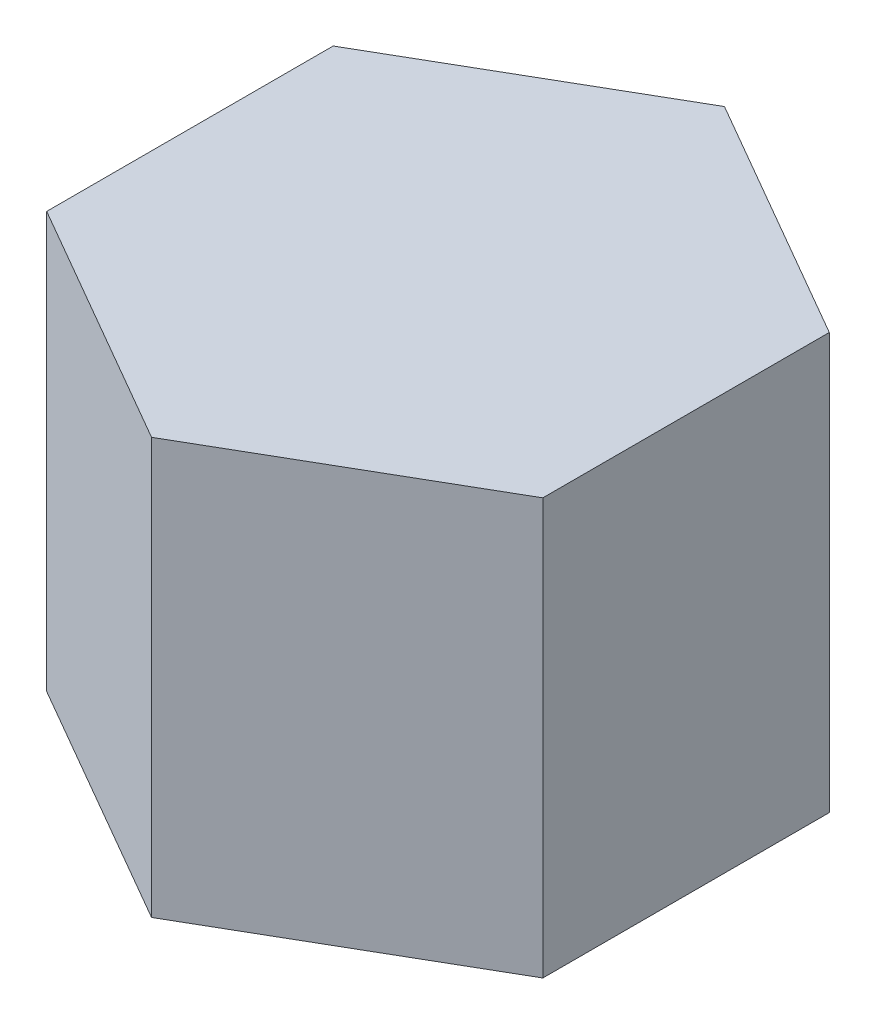
ISO-10303-21;
HEADER;
FILE_DESCRIPTION(('STEP AP214'),'2;1');
FILE_NAME('part.step','',(''),(''),'','','');
FILE_SCHEMA(('AUTOMOTIVE_DESIGN { 1 0 10303 214 1 1 1 1 }'));
ENDSEC;
DATA;
#1=APPLICATION_CONTEXT('core data for automotive mechanical design processes');
#2=APPLICATION_PROTOCOL_DEFINITION('international standard','automotive_design',2000,#1);
#3=PRODUCT_CONTEXT('',#1,'mechanical');
#4=PRODUCT('Part','Part','',(#3));
#5=PRODUCT_RELATED_PRODUCT_CATEGORY('part','',(#4));
#6=PRODUCT_DEFINITION_FORMATION('','',#4);
#7=PRODUCT_DEFINITION_CONTEXT('part definition',#1,'design');
#8=PRODUCT_DEFINITION('design','',#6,#7);
#9=PRODUCT_DEFINITION_SHAPE('','',#8);
#10=(LENGTH_UNIT() NAMED_UNIT(*) SI_UNIT(.MILLI.,.METRE.));
#11=(NAMED_UNIT(*) PLANE_ANGLE_UNIT() SI_UNIT($,.RADIAN.));
#12=(NAMED_UNIT(*) SI_UNIT($,.STERADIAN.) SOLID_ANGLE_UNIT());
#13=UNCERTAINTY_MEASURE_WITH_UNIT(LENGTH_MEASURE(1.E-05),#10,'distance_accuracy_value','');
#14=(GEOMETRIC_REPRESENTATION_CONTEXT(3) GLOBAL_UNCERTAINTY_ASSIGNED_CONTEXT((#13)) GLOBAL_UNIT_ASSIGNED_CONTEXT((#10,
#11,#12)) REPRESENTATION_CONTEXT('',''));
#15=CARTESIAN_POINT('',(0.,0.,0.));
#16=DIRECTION('',(0.,0.,1.));
#17=DIRECTION('',(1.,0.,0.));
#18=AXIS2_PLACEMENT_3D('',#15,#16,#17);
#19=CARTESIAN_POINT('',(210.642660308706,-148.537700895744,291.506971220494));
#20=DIRECTION('',(-0.499999999999909,0.,-0.866025403784491));
#21=DIRECTION('',(-0.866025403784491,0.,0.499999999999909));
#22=AXIS2_PLACEMENT_3D('',#19,#20,#21);
#23=PLANE('',#22);
#24=CARTESIAN_POINT('',(210.339551417382,-149.045793579175,291.681971220494));
#25=DIRECTION('',(0.866025403784491,0.,-0.499999999999909));
#26=VECTOR('',#25,1.);
#27=LINE('',#24,#26);
#28=CARTESIAN_POINT('',(210.339551417382,-149.045793579175,291.681971220494));
#29=VERTEX_POINT('',#28);
#30=CARTESIAN_POINT('',(210.642660308706,-149.045793579175,291.506971220494));
#31=VERTEX_POINT('',#30);
#32=EDGE_CURVE('E170',#29,#31,#27,.T.);
#33=ORIENTED_EDGE('',*,*,#32,.T.);
#34=CARTESIAN_POINT('',(210.642660308706,-148.537700895744,291.506971220494));
#35=DIRECTION('',(0.,-1.,0.));
#36=VECTOR('',#35,1.);
#37=LINE('',#34,#36);
#38=CARTESIAN_POINT('',(210.642660308706,-148.537700895744,291.506971220494));
#39=VERTEX_POINT('',#38);
#40=EDGE_CURVE('E35',#39,#31,#37,.T.);
#41=ORIENTED_EDGE('',*,*,#40,.F.);
#42=CARTESIAN_POINT('',(210.339551417382,-148.537700895744,291.681971220494));
#43=DIRECTION('',(0.866025403784491,0.,-0.499999999999909));
#44=VECTOR('',#43,1.);
#45=LINE('',#42,#44);
#46=CARTESIAN_POINT('',(210.339551417382,-148.537700895744,291.681971220494));
#47=VERTEX_POINT('',#46);
#48=EDGE_CURVE('E159',#47,#39,#45,.T.);
#49=ORIENTED_EDGE('',*,*,#48,.F.);
#50=CARTESIAN_POINT('',(210.339551417382,-148.537700895744,291.681971220494));
#51=DIRECTION('',(0.,-1.,0.));
#52=VECTOR('',#51,1.);
#53=LINE('',#50,#52);
#54=EDGE_CURVE('E10',#47,#29,#53,.T.);
#55=ORIENTED_EDGE('',*,*,#54,.T.);
#56=EDGE_LOOP('',(#33,#41,#49,#55));
#57=FACE_BOUND('',#56,.T.);
#58=ADVANCED_FACE('F16',(#57),#23,.F.);
#59=CARTESIAN_POINT('',(210.339551417382,-148.537700895744,291.681971220494));
#60=DIRECTION('',(0.500000000000096,0.,-0.866025403784383));
#61=DIRECTION('',(-0.866025403784383,0.,-0.500000000000096));
#62=AXIS2_PLACEMENT_3D('',#59,#60,#61);
#63=PLANE('',#62);
#64=CARTESIAN_POINT('',(210.036442526057,-149.045793579175,291.506971220494));
#65=DIRECTION('',(0.866025403784383,0.,0.500000000000096));
#66=VECTOR('',#65,1.);
#67=LINE('',#64,#66);
#68=CARTESIAN_POINT('',(210.036442526057,-149.045793579175,291.506971220494));
#69=VERTEX_POINT('',#68);
#70=EDGE_CURVE('E167',#69,#29,#67,.T.);
#71=ORIENTED_EDGE('',*,*,#70,.T.);
#72=ORIENTED_EDGE('',*,*,#54,.F.);
#73=CARTESIAN_POINT('',(210.036442526057,-148.537700895744,291.506971220494));
#74=DIRECTION('',(0.866025403784383,0.,0.500000000000096));
#75=VECTOR('',#74,1.);
#76=LINE('',#73,#75);
#77=CARTESIAN_POINT('',(210.036442526057,-148.537700895744,291.506971220494));
#78=VERTEX_POINT('',#77);
#79=EDGE_CURVE('E156',#78,#47,#76,.T.);
#80=ORIENTED_EDGE('',*,*,#79,.F.);
#81=CARTESIAN_POINT('',(210.036442526057,-148.537700895744,291.506971220494));
#82=DIRECTION('',(0.,-1.,0.));
#83=VECTOR('',#82,1.);
#84=LINE('',#81,#83);
#85=EDGE_CURVE('E27',#78,#69,#84,.T.);
#86=ORIENTED_EDGE('',*,*,#85,.T.);
#87=EDGE_LOOP('',(#71,#72,#80,#86));
#88=FACE_BOUND('',#87,.T.);
#89=ADVANCED_FACE('F189',(#88),#63,.F.);
#90=CARTESIAN_POINT('',(210.036442526057,-148.537700895744,290.831971220494));
#91=DIRECTION('',(1.,0.,0.));
#92=DIRECTION('',(0.,1.,0.));
#93=AXIS2_PLACEMENT_3D('',#90,#91,#92);
#94=PLANE('',#93);
#95=CARTESIAN_POINT('',(210.036442526057,-149.045793579175,291.156971220494));
#96=DIRECTION('',(0.,0.,1.));
#97=VECTOR('',#96,1.);
#98=LINE('',#95,#97);
#99=CARTESIAN_POINT('',(210.036442526057,-149.045793579175,291.156971220494));
#100=VERTEX_POINT('',#99);
#101=EDGE_CURVE('E163',#100,#69,#98,.T.);
#102=ORIENTED_EDGE('',*,*,#101,.T.);
#103=ORIENTED_EDGE('',*,*,#85,.F.);
#104=CARTESIAN_POINT('',(210.036442526057,-148.537700895744,291.156971220494));
#105=DIRECTION('',(0.,0.,1.));
#106=VECTOR('',#105,1.);
#107=LINE('',#104,#106);
#108=CARTESIAN_POINT('',(210.036442526057,-148.537700895744,291.156971220494));
#109=VERTEX_POINT('',#108);
#110=EDGE_CURVE('E106',#109,#78,#107,.T.);
#111=ORIENTED_EDGE('',*,*,#110,.F.);
#112=CARTESIAN_POINT('',(210.036442526057,-148.537700895744,291.156971220494));
#113=DIRECTION('',(0.,-1.,0.));
#114=VECTOR('',#113,1.);
#115=LINE('',#112,#114);
#116=EDGE_CURVE('E94',#109,#100,#115,.T.);
#117=ORIENTED_EDGE('',*,*,#116,.T.);
#118=EDGE_LOOP('',(#102,#103,#111,#117));
#119=FACE_BOUND('',#118,.T.);
#120=ADVANCED_FACE('F198',(#119),#94,.F.);
#121=CARTESIAN_POINT('',(210.036442526057,-148.537700895744,291.156971220494));
#122=DIRECTION('',(0.499999999999943,0.,0.866025403784472));
#123=DIRECTION('',(0.866025403784472,0.,-0.499999999999943));
#124=AXIS2_PLACEMENT_3D('',#121,#122,#123);
#125=PLANE('',#124);
#126=CARTESIAN_POINT('',(210.339551417382,-149.045793579175,290.981971220494));
#127=DIRECTION('',(-0.866025403784471,0.,0.499999999999943));
#128=VECTOR('',#127,1.);
#129=LINE('',#126,#128);
#130=CARTESIAN_POINT('',(210.339551417382,-149.045793579175,290.981971220494));
#131=VERTEX_POINT('',#130);
#132=EDGE_CURVE('E162',#131,#100,#129,.T.);
#133=ORIENTED_EDGE('',*,*,#132,.T.);
#134=ORIENTED_EDGE('',*,*,#116,.F.);
#135=CARTESIAN_POINT('',(210.339551417382,-148.537700895744,290.981971220494));
#136=DIRECTION('',(-0.866025403784471,0.,0.499999999999943));
#137=VECTOR('',#136,1.);
#138=LINE('',#135,#137);
#139=CARTESIAN_POINT('',(210.339551417382,-148.537700895744,290.981971220494));
#140=VERTEX_POINT('',#139);
#141=EDGE_CURVE('E98',#140,#109,#138,.T.);
#142=ORIENTED_EDGE('',*,*,#141,.F.);
#143=CARTESIAN_POINT('',(210.339551417382,-148.537700895744,290.981971220494));
#144=DIRECTION('',(0.,-1.,0.));
#145=VECTOR('',#144,1.);
#146=LINE('',#143,#145);
#147=EDGE_CURVE('E79',#140,#131,#146,.T.);
#148=ORIENTED_EDGE('',*,*,#147,.T.);
#149=EDGE_LOOP('',(#133,#134,#142,#148));
#150=FACE_BOUND('',#149,.T.);
#151=ADVANCED_FACE('F100',(#150),#125,.F.);
#152=CARTESIAN_POINT('',(210.339551417382,-148.537700895744,290.981971220494));
#153=DIRECTION('',(-0.500000000000062,0.,0.866025403784403));
#154=DIRECTION('',(0.866025403784403,0.,0.500000000000062));
#155=AXIS2_PLACEMENT_3D('',#152,#153,#154);
#156=PLANE('',#155);
#157=CARTESIAN_POINT('',(210.642660308706,-149.045793579175,291.156971220494));
#158=DIRECTION('',(-0.866025403784403,0.,-0.500000000000062));
#159=VECTOR('',#158,1.);
#160=LINE('',#157,#159);
#161=CARTESIAN_POINT('',(210.642660308706,-149.045793579175,291.156971220494));
#162=VERTEX_POINT('',#161);
#163=EDGE_CURVE('E88',#162,#131,#160,.T.);
#164=ORIENTED_EDGE('',*,*,#163,.T.);
#165=ORIENTED_EDGE('',*,*,#147,.F.);
#166=CARTESIAN_POINT('',(210.642660308706,-148.537700895744,291.156971220494));
#167=DIRECTION('',(-0.866025403784403,0.,-0.500000000000062));
#168=VECTOR('',#167,1.);
#169=LINE('',#166,#168);
#170=CARTESIAN_POINT('',(210.642660308706,-148.537700895744,291.156971220494));
#171=VERTEX_POINT('',#170);
#172=EDGE_CURVE('E84',#171,#140,#169,.T.);
#173=ORIENTED_EDGE('',*,*,#172,.F.);
#174=CARTESIAN_POINT('',(210.642660308706,-148.537700895744,291.156971220494));
#175=DIRECTION('',(0.,-1.,0.));
#176=VECTOR('',#175,1.);
#177=LINE('',#174,#176);
#178=EDGE_CURVE('E58',#171,#162,#177,.T.);
#179=ORIENTED_EDGE('',*,*,#178,.T.);
#180=EDGE_LOOP('',(#164,#165,#173,#179));
#181=FACE_BOUND('',#180,.T.);
#182=ADVANCED_FACE('F82',(#181),#156,.F.);
#183=CARTESIAN_POINT('',(210.642660308706,-148.537700895744,290.831971220494));
#184=DIRECTION('',(-1.,0.,0.));
#185=DIRECTION('',(0.,-1.,0.));
#186=AXIS2_PLACEMENT_3D('',#183,#184,#185);
#187=PLANE('',#186);
#188=CARTESIAN_POINT('',(210.642660308706,-149.045793579175,291.506971220494));
#189=DIRECTION('',(0.,0.,-1.));
#190=VECTOR('',#189,1.);
#191=LINE('',#188,#190);
#192=EDGE_CURVE('E160',#31,#162,#191,.T.);
#193=ORIENTED_EDGE('',*,*,#192,.T.);
#194=ORIENTED_EDGE('',*,*,#178,.F.);
#195=CARTESIAN_POINT('',(210.642660308706,-148.537700895744,291.506971220494));
#196=DIRECTION('',(0.,0.,-1.));
#197=VECTOR('',#196,1.);
#198=LINE('',#195,#197);
#199=EDGE_CURVE('E112',#39,#171,#198,.T.);
#200=ORIENTED_EDGE('',*,*,#199,.F.);
#201=ORIENTED_EDGE('',*,*,#40,.T.);
#202=EDGE_LOOP('',(#193,#194,#200,#201));
#203=FACE_BOUND('',#202,.T.);
#204=ADVANCED_FACE('F131',(#203),#187,.F.);
#205=CARTESIAN_POINT('',(206.339551417382,-148.537700895744,290.831971220494));
#206=DIRECTION('',(0.,-1.,0.));
#207=DIRECTION('',(1.,0.,0.));
#208=AXIS2_PLACEMENT_3D('',#205,#206,#207);
#209=PLANE('',#208);
#210=ORIENTED_EDGE('',*,*,#48,.T.);
#211=ORIENTED_EDGE('',*,*,#199,.T.);
#212=ORIENTED_EDGE('',*,*,#172,.T.);
#213=ORIENTED_EDGE('',*,*,#141,.T.);
#214=ORIENTED_EDGE('',*,*,#110,.T.);
#215=ORIENTED_EDGE('',*,*,#79,.T.);
#216=EDGE_LOOP('',(#210,#211,#212,#213,#214,#215));
#217=FACE_BOUND('',#216,.T.);
#218=ADVANCED_FACE('F111',(#217),#209,.F.);
#219=CARTESIAN_POINT('',(206.339551417382,-149.045793579175,290.831971220494));
#220=DIRECTION('',(0.,-1.,0.));
#221=DIRECTION('',(1.,0.,0.));
#222=AXIS2_PLACEMENT_3D('',#219,#220,#221);
#223=PLANE('',#222);
#224=ORIENTED_EDGE('',*,*,#32,.F.);
#225=ORIENTED_EDGE('',*,*,#70,.F.);
#226=ORIENTED_EDGE('',*,*,#101,.F.);
#227=ORIENTED_EDGE('',*,*,#132,.F.);
#228=ORIENTED_EDGE('',*,*,#163,.F.);
#229=ORIENTED_EDGE('',*,*,#192,.F.);
#230=EDGE_LOOP('',(#224,#225,#226,#227,#228,#229));
#231=FACE_BOUND('',#230,.T.);
#232=ADVANCED_FACE('F130',(#231),#223,.T.);
#233=CLOSED_SHELL('',(#58,#89,#120,#151,#182,#204,#218,#232));
#234=MANIFOLD_SOLID_BREP('B1',#233);
#235=ADVANCED_BREP_SHAPE_REPRESENTATION('',(#18,#234),#14);
#236=SHAPE_DEFINITION_REPRESENTATION(#9,#235);
ENDSEC;
END-ISO-10303-21;
